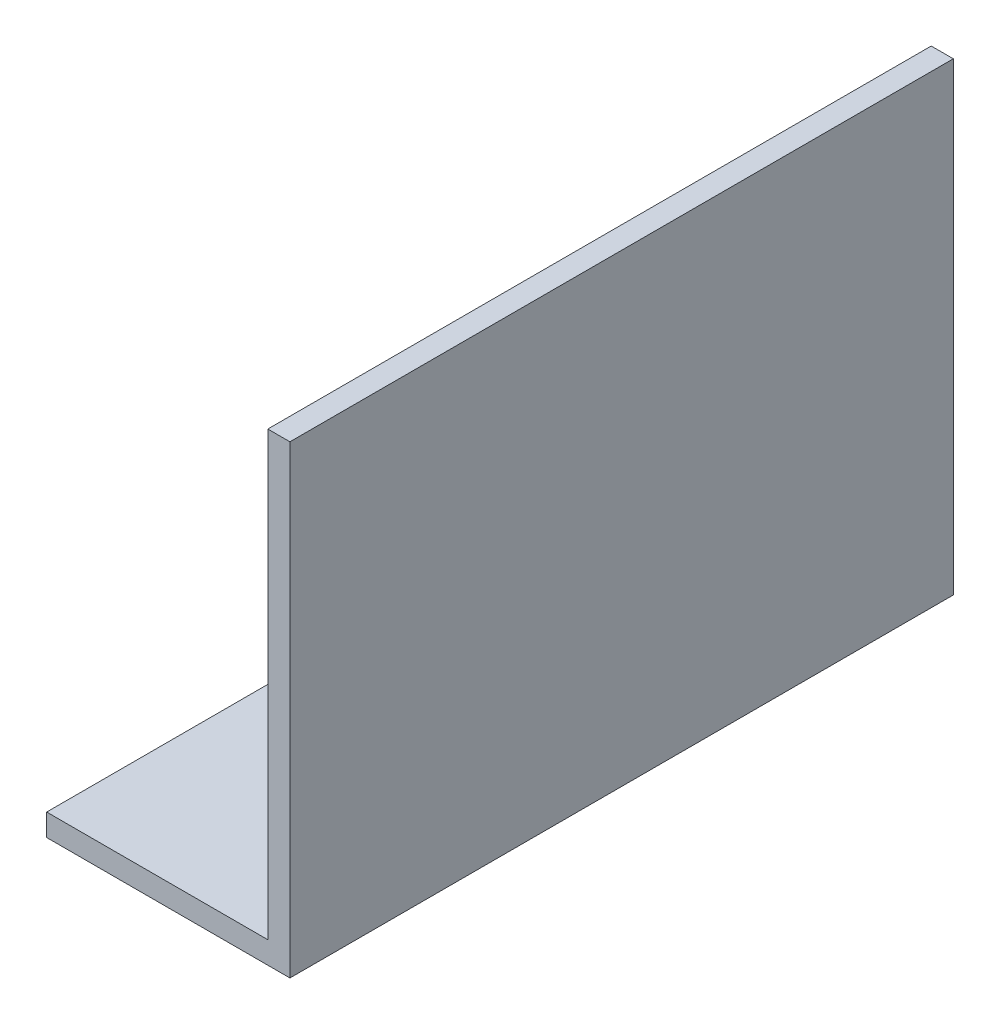
ISO-10303-21;
HEADER;
FILE_DESCRIPTION(('STEP AP214'),'2;1');
FILE_NAME('part.step','',(''),(''),'','','');
FILE_SCHEMA(('AUTOMOTIVE_DESIGN { 1 0 10303 214 1 1 1 1 }'));
ENDSEC;
DATA;
#1=APPLICATION_CONTEXT('core data for automotive mechanical design processes');
#2=APPLICATION_PROTOCOL_DEFINITION('international standard','automotive_design',2000,#1);
#3=PRODUCT_CONTEXT('',#1,'mechanical');
#4=PRODUCT('Part','Part','',(#3));
#5=PRODUCT_RELATED_PRODUCT_CATEGORY('part','',(#4));
#6=PRODUCT_DEFINITION_FORMATION('','',#4);
#7=PRODUCT_DEFINITION_CONTEXT('part definition',#1,'design');
#8=PRODUCT_DEFINITION('design','',#6,#7);
#9=PRODUCT_DEFINITION_SHAPE('','',#8);
#10=(LENGTH_UNIT() NAMED_UNIT(*) SI_UNIT(.MILLI.,.METRE.));
#11=(NAMED_UNIT(*) PLANE_ANGLE_UNIT() SI_UNIT($,.RADIAN.));
#12=(NAMED_UNIT(*) SI_UNIT($,.STERADIAN.) SOLID_ANGLE_UNIT());
#13=UNCERTAINTY_MEASURE_WITH_UNIT(LENGTH_MEASURE(1.E-05),#10,'distance_accuracy_value','');
#14=(GEOMETRIC_REPRESENTATION_CONTEXT(3) GLOBAL_UNCERTAINTY_ASSIGNED_CONTEXT((#13)) GLOBAL_UNIT_ASSIGNED_CONTEXT((#10,
#11,#12)) REPRESENTATION_CONTEXT('',''));
#15=CARTESIAN_POINT('',(0.,0.,0.));
#16=DIRECTION('',(0.,0.,1.));
#17=DIRECTION('',(1.,0.,0.));
#18=AXIS2_PLACEMENT_3D('',#15,#16,#17);
#19=CARTESIAN_POINT('',(22.,0.,60.));
#20=DIRECTION('',(-1.,0.,0.));
#21=DIRECTION('',(0.,0.,1.));
#22=AXIS2_PLACEMENT_3D('',#19,#20,#21);
#23=PLANE('',#22);
#24=DIRECTION('',(0.,1.,0.));
#25=VECTOR('',#24,1.);
#26=CARTESIAN_POINT('',(22.,0.,0.));
#27=LINE('',#26,#25);
#28=CARTESIAN_POINT('',(22.,-2.,0.));
#29=VERTEX_POINT('',#28);
#30=CARTESIAN_POINT('',(22.,40.,0.));
#31=VERTEX_POINT('',#30);
#32=EDGE_CURVE('E112',#29,#31,#27,.T.);
#33=ORIENTED_EDGE('',*,*,#32,.T.);
#34=DIRECTION('',(0.,0.,-1.));
#35=VECTOR('',#34,1.);
#36=CARTESIAN_POINT('',(22.,40.,60.));
#37=LINE('',#36,#35);
#38=CARTESIAN_POINT('',(22.,40.,60.));
#39=VERTEX_POINT('',#38);
#40=EDGE_CURVE('E11',#39,#31,#37,.T.);
#41=ORIENTED_EDGE('',*,*,#40,.F.);
#42=DIRECTION('',(0.,1.,0.));
#43=VECTOR('',#42,1.);
#44=CARTESIAN_POINT('',(22.,0.,60.));
#45=LINE('',#44,#43);
#46=CARTESIAN_POINT('',(22.,-2.,60.));
#47=VERTEX_POINT('',#46);
#48=EDGE_CURVE('E77',#47,#39,#45,.T.);
#49=ORIENTED_EDGE('',*,*,#48,.F.);
#50=DIRECTION('',(0.,0.,-1.));
#51=VECTOR('',#50,1.);
#52=CARTESIAN_POINT('',(22.,-2.,60.));
#53=LINE('',#52,#51);
#54=EDGE_CURVE('E108',#47,#29,#53,.T.);
#55=ORIENTED_EDGE('',*,*,#54,.T.);
#56=EDGE_LOOP('',(#33,#41,#49,#55));
#57=FACE_BOUND('',#56,.T.);
#58=ADVANCED_FACE('F31',(#57),#23,.F.);
#59=CARTESIAN_POINT('',(20.,40.,60.));
#60=DIRECTION('',(0.,1.,0.));
#61=DIRECTION('',(0.,0.,1.));
#62=AXIS2_PLACEMENT_3D('',#59,#60,#61);
#63=PLANE('',#62);
#64=DIRECTION('',(1.,0.,0.));
#65=VECTOR('',#64,1.);
#66=CARTESIAN_POINT('',(20.,40.,0.));
#67=LINE('',#66,#65);
#68=CARTESIAN_POINT('',(20.,40.,0.));
#69=VERTEX_POINT('',#68);
#70=EDGE_CURVE('E115',#69,#31,#67,.T.);
#71=ORIENTED_EDGE('',*,*,#70,.F.);
#72=DIRECTION('',(0.,0.,-1.));
#73=VECTOR('',#72,1.);
#74=CARTESIAN_POINT('',(20.,40.,60.));
#75=LINE('',#74,#73);
#76=CARTESIAN_POINT('',(20.,40.,60.));
#77=VERTEX_POINT('',#76);
#78=EDGE_CURVE('E39',#77,#69,#75,.T.);
#79=ORIENTED_EDGE('',*,*,#78,.F.);
#80=DIRECTION('',(1.,0.,0.));
#81=VECTOR('',#80,1.);
#82=CARTESIAN_POINT('',(20.,40.,60.));
#83=LINE('',#82,#81);
#84=EDGE_CURVE('E201',#77,#39,#83,.T.);
#85=ORIENTED_EDGE('',*,*,#84,.T.);
#86=ORIENTED_EDGE('',*,*,#40,.T.);
#87=EDGE_LOOP('',(#71,#79,#85,#86));
#88=FACE_BOUND('',#87,.T.);
#89=ADVANCED_FACE('F133',(#88),#63,.T.);
#90=CARTESIAN_POINT('',(20.,0.,60.));
#91=DIRECTION('',(-1.,0.,0.));
#92=DIRECTION('',(0.,0.,1.));
#93=AXIS2_PLACEMENT_3D('',#90,#91,#92);
#94=PLANE('',#93);
#95=DIRECTION('',(0.,1.,0.));
#96=VECTOR('',#95,1.);
#97=CARTESIAN_POINT('',(20.,0.,0.));
#98=LINE('',#97,#96);
#99=CARTESIAN_POINT('',(20.,0.,0.));
#100=VERTEX_POINT('',#99);
#101=EDGE_CURVE('E118',#100,#69,#98,.T.);
#102=ORIENTED_EDGE('',*,*,#101,.F.);
#103=DIRECTION('',(0.,0.,-1.));
#104=VECTOR('',#103,1.);
#105=CARTESIAN_POINT('',(20.,0.,60.));
#106=LINE('',#105,#104);
#107=CARTESIAN_POINT('',(20.,0.,60.));
#108=VERTEX_POINT('',#107);
#109=EDGE_CURVE('E98',#108,#100,#106,.T.);
#110=ORIENTED_EDGE('',*,*,#109,.F.);
#111=DIRECTION('',(0.,1.,0.));
#112=VECTOR('',#111,1.);
#113=CARTESIAN_POINT('',(20.,0.,60.));
#114=LINE('',#113,#112);
#115=EDGE_CURVE('E104',#108,#77,#114,.T.);
#116=ORIENTED_EDGE('',*,*,#115,.T.);
#117=ORIENTED_EDGE('',*,*,#78,.T.);
#118=EDGE_LOOP('',(#102,#110,#116,#117));
#119=FACE_BOUND('',#118,.T.);
#120=ADVANCED_FACE('F130',(#119),#94,.T.);
#121=CARTESIAN_POINT('',(0.,0.,60.));
#122=DIRECTION('',(0.,1.,0.));
#123=DIRECTION('',(0.,0.,1.));
#124=AXIS2_PLACEMENT_3D('',#121,#122,#123);
#125=PLANE('',#124);
#126=DIRECTION('',(1.,0.,0.));
#127=VECTOR('',#126,1.);
#128=CARTESIAN_POINT('',(0.,0.,0.));
#129=LINE('',#128,#127);
#130=CARTESIAN_POINT('',(0.,0.,0.));
#131=VERTEX_POINT('',#130);
#132=EDGE_CURVE('E93',#131,#100,#129,.T.);
#133=ORIENTED_EDGE('',*,*,#132,.F.);
#134=DIRECTION('',(0.,0.,-1.));
#135=VECTOR('',#134,1.);
#136=CARTESIAN_POINT('',(0.,0.,60.));
#137=LINE('',#136,#135);
#138=CARTESIAN_POINT('',(0.,0.,60.));
#139=VERTEX_POINT('',#138);
#140=EDGE_CURVE('E88',#139,#131,#137,.T.);
#141=ORIENTED_EDGE('',*,*,#140,.F.);
#142=DIRECTION('',(1.,0.,0.));
#143=VECTOR('',#142,1.);
#144=CARTESIAN_POINT('',(0.,0.,60.));
#145=LINE('',#144,#143);
#146=EDGE_CURVE('E91',#139,#108,#145,.T.);
#147=ORIENTED_EDGE('',*,*,#146,.T.);
#148=ORIENTED_EDGE('',*,*,#109,.T.);
#149=EDGE_LOOP('',(#133,#141,#147,#148));
#150=FACE_BOUND('',#149,.T.);
#151=ADVANCED_FACE('F90',(#150),#125,.T.);
#152=CARTESIAN_POINT('',(0.,-2.,60.));
#153=DIRECTION('',(-1.,0.,0.));
#154=DIRECTION('',(0.,0.,1.));
#155=AXIS2_PLACEMENT_3D('',#152,#153,#154);
#156=PLANE('',#155);
#157=DIRECTION('',(0.,1.,0.));
#158=VECTOR('',#157,1.);
#159=CARTESIAN_POINT('',(0.,-2.,0.));
#160=LINE('',#159,#158);
#161=CARTESIAN_POINT('',(0.,-2.,0.));
#162=VERTEX_POINT('',#161);
#163=EDGE_CURVE('E122',#162,#131,#160,.T.);
#164=ORIENTED_EDGE('',*,*,#163,.F.);
#165=DIRECTION('',(0.,0.,-1.));
#166=VECTOR('',#165,1.);
#167=CARTESIAN_POINT('',(0.,-2.,60.));
#168=LINE('',#167,#166);
#169=CARTESIAN_POINT('',(0.,-2.,60.));
#170=VERTEX_POINT('',#169);
#171=EDGE_CURVE('E68',#170,#162,#168,.T.);
#172=ORIENTED_EDGE('',*,*,#171,.F.);
#173=DIRECTION('',(0.,1.,0.));
#174=VECTOR('',#173,1.);
#175=CARTESIAN_POINT('',(0.,-2.,60.));
#176=LINE('',#175,#174);
#177=EDGE_CURVE('E102',#170,#139,#176,.T.);
#178=ORIENTED_EDGE('',*,*,#177,.T.);
#179=ORIENTED_EDGE('',*,*,#140,.T.);
#180=EDGE_LOOP('',(#164,#172,#178,#179));
#181=FACE_BOUND('',#180,.T.);
#182=ADVANCED_FACE('F106',(#181),#156,.T.);
#183=CARTESIAN_POINT('',(0.,-2.,60.));
#184=DIRECTION('',(0.,1.,0.));
#185=DIRECTION('',(0.,0.,1.));
#186=AXIS2_PLACEMENT_3D('',#183,#184,#185);
#187=PLANE('',#186);
#188=DIRECTION('',(1.,0.,0.));
#189=VECTOR('',#188,1.);
#190=CARTESIAN_POINT('',(0.,-2.,0.));
#191=LINE('',#190,#189);
#192=EDGE_CURVE('E71',#162,#29,#191,.T.);
#193=ORIENTED_EDGE('',*,*,#192,.T.);
#194=ORIENTED_EDGE('',*,*,#54,.F.);
#195=DIRECTION('',(1.,0.,0.));
#196=VECTOR('',#195,1.);
#197=CARTESIAN_POINT('',(0.,-2.,60.));
#198=LINE('',#197,#196);
#199=EDGE_CURVE('E47',#170,#47,#198,.T.);
#200=ORIENTED_EDGE('',*,*,#199,.F.);
#201=ORIENTED_EDGE('',*,*,#171,.T.);
#202=EDGE_LOOP('',(#193,#194,#200,#201));
#203=FACE_BOUND('',#202,.T.);
#204=ADVANCED_FACE('F138',(#203),#187,.F.);
#205=CARTESIAN_POINT('',(22.,40.,60.));
#206=DIRECTION('',(0.,0.,-1.));
#207=DIRECTION('',(-1.,0.,0.));
#208=AXIS2_PLACEMENT_3D('',#205,#206,#207);
#209=PLANE('',#208);
#210=ORIENTED_EDGE('',*,*,#48,.T.);
#211=ORIENTED_EDGE('',*,*,#84,.F.);
#212=ORIENTED_EDGE('',*,*,#115,.F.);
#213=ORIENTED_EDGE('',*,*,#146,.F.);
#214=ORIENTED_EDGE('',*,*,#177,.F.);
#215=ORIENTED_EDGE('',*,*,#199,.T.);
#216=EDGE_LOOP('',(#210,#211,#212,#213,#214,#215));
#217=FACE_BOUND('',#216,.T.);
#218=ADVANCED_FACE('F101',(#217),#209,.F.);
#219=CARTESIAN_POINT('',(22.,40.,0.));
#220=DIRECTION('',(0.,0.,-1.));
#221=DIRECTION('',(-1.,0.,0.));
#222=AXIS2_PLACEMENT_3D('',#219,#220,#221);
#223=PLANE('',#222);
#224=ORIENTED_EDGE('',*,*,#32,.F.);
#225=ORIENTED_EDGE('',*,*,#192,.F.);
#226=ORIENTED_EDGE('',*,*,#163,.T.);
#227=ORIENTED_EDGE('',*,*,#132,.T.);
#228=ORIENTED_EDGE('',*,*,#101,.T.);
#229=ORIENTED_EDGE('',*,*,#70,.T.);
#230=EDGE_LOOP('',(#224,#225,#226,#227,#228,#229));
#231=FACE_BOUND('',#230,.T.);
#232=ADVANCED_FACE('F136',(#231),#223,.T.);
#233=CLOSED_SHELL('',(#58,#89,#120,#151,#182,#204,#218,#232));
#234=MANIFOLD_SOLID_BREP('B2',#233);
#235=ADVANCED_BREP_SHAPE_REPRESENTATION('',(#18,#234),#14);
#236=SHAPE_DEFINITION_REPRESENTATION(#9,#235);
ENDSEC;
END-ISO-10303-21;
